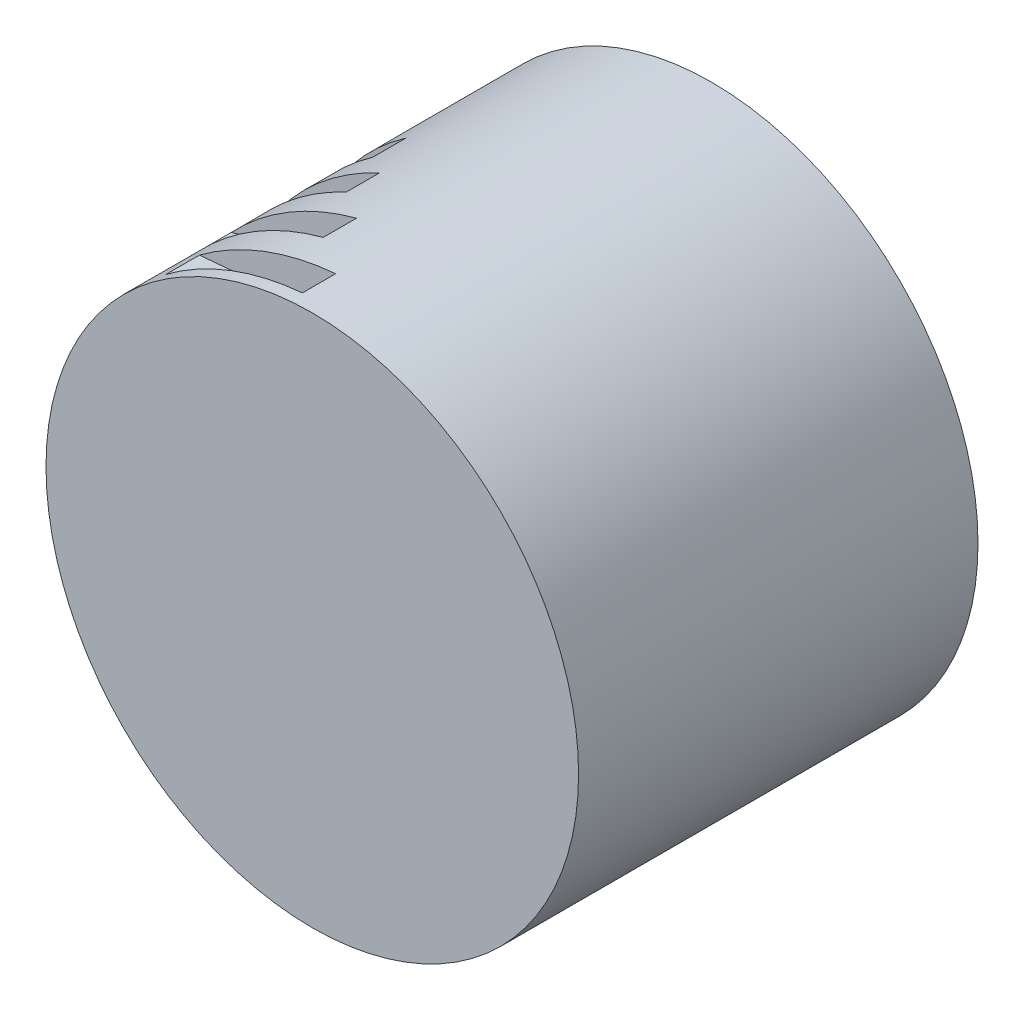
ISO-10303-21;
HEADER;
FILE_DESCRIPTION(('STEP AP214'),'2;1');
FILE_NAME('part.step','',(''),(''),'','','');
FILE_SCHEMA(('AUTOMOTIVE_DESIGN { 1 0 10303 214 1 1 1 1 }'));
ENDSEC;
DATA;
#1=APPLICATION_CONTEXT('core data for automotive mechanical design processes');
#2=APPLICATION_PROTOCOL_DEFINITION('international standard','automotive_design',2000,#1);
#3=PRODUCT_CONTEXT('',#1,'mechanical');
#4=PRODUCT('Part','Part','',(#3));
#5=PRODUCT_RELATED_PRODUCT_CATEGORY('part','',(#4));
#6=PRODUCT_DEFINITION_FORMATION('','',#4);
#7=PRODUCT_DEFINITION_CONTEXT('part definition',#1,'design');
#8=PRODUCT_DEFINITION('design','',#6,#7);
#9=PRODUCT_DEFINITION_SHAPE('','',#8);
#10=(LENGTH_UNIT() NAMED_UNIT(*) SI_UNIT(.MILLI.,.METRE.));
#11=(NAMED_UNIT(*) PLANE_ANGLE_UNIT() SI_UNIT($,.RADIAN.));
#12=(NAMED_UNIT(*) SI_UNIT($,.STERADIAN.) SOLID_ANGLE_UNIT());
#13=UNCERTAINTY_MEASURE_WITH_UNIT(LENGTH_MEASURE(1.E-05),#10,'distance_accuracy_value','');
#14=(GEOMETRIC_REPRESENTATION_CONTEXT(3) GLOBAL_UNCERTAINTY_ASSIGNED_CONTEXT((#13)) GLOBAL_UNIT_ASSIGNED_CONTEXT((#10,
#11,#12)) REPRESENTATION_CONTEXT('',''));
#15=CARTESIAN_POINT('',(0.,0.,0.));
#16=DIRECTION('',(0.,0.,1.));
#17=DIRECTION('',(1.,0.,0.));
#18=AXIS2_PLACEMENT_3D('',#15,#16,#17);
#19=CARTESIAN_POINT('',(0.,0.,300.));
#20=DIRECTION('',(0.,0.,-1.));
#21=DIRECTION('',(-1.,0.,0.));
#22=AXIS2_PLACEMENT_3D('',#19,#20,#21);
#23=CYLINDRICAL_SURFACE('',#22,400.);
#24=CARTESIAN_POINT('',(0.,0.,30.));
#25=DIRECTION('',(0.,0.,1.));
#26=DIRECTION('',(1.,0.,0.));
#27=AXIS2_PLACEMENT_3D('',#24,#25,#26);
#28=CIRCLE('',#27,400.);
#29=CARTESIAN_POINT('',(-169.047304696278,362.523114814661,30.));
#30=VERTEX_POINT('',#29);
#31=CARTESIAN_POINT('',(-334.661109746483,219.093454085813,30.));
#32=VERTEX_POINT('',#31);
#33=EDGE_CURVE('E168',#30,#32,#28,.T.);
#34=ORIENTED_EDGE('',*,*,#33,.F.);
#35=DIRECTION('',(0.,0.,1.));
#36=VECTOR('',#35,1.);
#37=CARTESIAN_POINT('',(-169.047304696278,362.523114814661,30.));
#38=LINE('',#37,#36);
#39=CARTESIAN_POINT('',(-169.047304696278,362.523114814661,80.));
#40=VERTEX_POINT('',#39);
#41=EDGE_CURVE('E186',#30,#40,#38,.T.);
#42=ORIENTED_EDGE('',*,*,#41,.T.);
#43=CARTESIAN_POINT('',(0.,0.,80.));
#44=DIRECTION('',(0.,0.,1.));
#45=DIRECTION('',(1.,0.,0.));
#46=AXIS2_PLACEMENT_3D('',#43,#44,#45);
#47=CIRCLE('',#46,400.);
#48=CARTESIAN_POINT('',(-334.661109746483,219.093454085813,80.));
#49=VERTEX_POINT('',#48);
#50=EDGE_CURVE('E179',#40,#49,#47,.T.);
#51=ORIENTED_EDGE('',*,*,#50,.T.);
#52=DIRECTION('',(0.,0.,1.));
#53=VECTOR('',#52,1.);
#54=CARTESIAN_POINT('',(-334.661109746483,219.093454085813,30.));
#55=LINE('',#54,#53);
#56=EDGE_CURVE('E178',#32,#49,#55,.T.);
#57=ORIENTED_EDGE('',*,*,#56,.F.);
#58=EDGE_LOOP('',(#34,#42,#51,#57));
#59=FACE_BOUND('',#58,.T.);
#60=CARTESIAN_POINT('',(0.,0.,-170.));
#61=DIRECTION('',(0.,0.,1.));
#62=DIRECTION('',(1.,0.,0.));
#63=AXIS2_PLACEMENT_3D('',#60,#61,#62);
#64=CIRCLE('',#63,400.);
#65=CARTESIAN_POINT('',(-282.842712474617,282.84271247462,-170.));
#66=VERTEX_POINT('',#65);
#67=CARTESIAN_POINT('',(-389.412949860939,91.4196613459148,-170.));
#68=VERTEX_POINT('',#67);
#69=EDGE_CURVE('E218',#66,#68,#64,.T.);
#70=ORIENTED_EDGE('',*,*,#69,.F.);
#71=DIRECTION('',(0.,0.,1.));
#72=VECTOR('',#71,1.);
#73=CARTESIAN_POINT('',(-282.842712474617,282.84271247462,-170.));
#74=LINE('',#73,#72);
#75=CARTESIAN_POINT('',(-282.842712474617,282.84271247462,-120.));
#76=VERTEX_POINT('',#75);
#77=EDGE_CURVE('E207',#66,#76,#74,.T.);
#78=ORIENTED_EDGE('',*,*,#77,.T.);
#79=CARTESIAN_POINT('',(0.,0.,-120.));
#80=DIRECTION('',(0.,0.,1.));
#81=DIRECTION('',(1.,0.,0.));
#82=AXIS2_PLACEMENT_3D('',#79,#80,#81);
#83=CIRCLE('',#82,400.);
#84=CARTESIAN_POINT('',(-389.412949860939,91.4196613459148,-120.));
#85=VERTEX_POINT('',#84);
#86=EDGE_CURVE('E229',#76,#85,#83,.T.);
#87=ORIENTED_EDGE('',*,*,#86,.T.);
#88=DIRECTION('',(0.,0.,1.));
#89=VECTOR('',#88,1.);
#90=CARTESIAN_POINT('',(-389.412949860939,91.4196613459148,-170.));
#91=LINE('',#90,#89);
#92=EDGE_CURVE('E228',#68,#85,#91,.T.);
#93=ORIENTED_EDGE('',*,*,#92,.F.);
#94=EDGE_LOOP('',(#70,#78,#87,#93));
#95=FACE_BOUND('',#94,.T.);
#96=CARTESIAN_POINT('',(0.,0.,-300.));
#97=DIRECTION('',(0.,0.,1.));
#98=DIRECTION('',(1.,0.,0.));
#99=AXIS2_PLACEMENT_3D('',#96,#97,#98);
#100=CIRCLE('',#99,400.);
#101=CARTESIAN_POINT('',(400.,0.,-300.));
#102=VERTEX_POINT('',#101);
#103=EDGE_CURVE('E38',#102,#102,#100,.T.);
#104=ORIENTED_EDGE('',*,*,#103,.T.);
#105=EDGE_LOOP('',(#104));
#106=FACE_BOUND('',#105,.T.);
#107=CARTESIAN_POINT('',(0.,0.,300.));
#108=DIRECTION('',(0.,0.,1.));
#109=DIRECTION('',(1.,0.,0.));
#110=AXIS2_PLACEMENT_3D('',#107,#108,#109);
#111=CIRCLE('',#110,400.);
#112=CARTESIAN_POINT('',(400.,0.,300.));
#113=VERTEX_POINT('',#112);
#114=EDGE_CURVE('E11',#113,#113,#111,.T.);
#115=ORIENTED_EDGE('',*,*,#114,.F.);
#116=EDGE_LOOP('',(#115));
#117=FACE_BOUND('',#116,.T.);
#118=CARTESIAN_POINT('',(0.,0.,230.));
#119=DIRECTION('',(0.,0.,1.));
#120=DIRECTION('',(1.,0.,0.));
#121=AXIS2_PLACEMENT_3D('',#118,#119,#120);
#122=CIRCLE('',#121,400.);
#123=CARTESIAN_POINT('',(-34.8622970990606,398.477879236698,230.));
#124=VERTEX_POINT('',#123);
#125=CARTESIAN_POINT('',(-239.544200724648,320.341342787954,230.));
#126=VERTEX_POINT('',#125);
#127=EDGE_CURVE('E243',#124,#126,#122,.T.);
#128=ORIENTED_EDGE('',*,*,#127,.F.);
#129=DIRECTION('',(0.,0.,1.));
#130=VECTOR('',#129,1.);
#131=CARTESIAN_POINT('',(-34.8622970990606,398.477879236698,230.));
#132=LINE('',#131,#130);
#133=CARTESIAN_POINT('',(-34.8622970990606,398.477879236698,280.));
#134=VERTEX_POINT('',#133);
#135=EDGE_CURVE('E262',#124,#134,#132,.T.);
#136=ORIENTED_EDGE('',*,*,#135,.T.);
#137=CARTESIAN_POINT('',(0.,0.,280.));
#138=DIRECTION('',(0.,0.,1.));
#139=DIRECTION('',(1.,0.,0.));
#140=AXIS2_PLACEMENT_3D('',#137,#138,#139);
#141=CIRCLE('',#140,400.);
#142=CARTESIAN_POINT('',(-239.544200724648,320.341342787954,280.));
#143=VERTEX_POINT('',#142);
#144=EDGE_CURVE('E254',#134,#143,#141,.T.);
#145=ORIENTED_EDGE('',*,*,#144,.T.);
#146=DIRECTION('',(0.,0.,1.));
#147=VECTOR('',#146,1.);
#148=CARTESIAN_POINT('',(-239.544200724648,320.341342787954,230.));
#149=LINE('',#148,#147);
#150=EDGE_CURVE('E253',#126,#143,#149,.T.);
#151=ORIENTED_EDGE('',*,*,#150,.F.);
#152=EDGE_LOOP('',(#128,#136,#145,#151));
#153=FACE_BOUND('',#152,.T.);
#154=CARTESIAN_POINT('',(0.,0.,-70.0000000000001));
#155=DIRECTION('',(0.,0.,1.));
#156=DIRECTION('',(1.,0.,0.));
#157=AXIS2_PLACEMENT_3D('',#154,#155,#156);
#158=CIRCLE('',#157,400.);
#159=CARTESIAN_POINT('',(-229.430574540417,327.660817715598,-70.0000000000001));
#160=VERTEX_POINT('',#159);
#161=CARTESIAN_POINT('',(-367.622034550761,157.651640374463,-70.0000000000001));
#162=VERTEX_POINT('',#161);
#163=EDGE_CURVE('E192',#160,#162,#158,.T.);
#164=ORIENTED_EDGE('',*,*,#163,.F.);
#165=DIRECTION('',(0.,0.,1.));
#166=VECTOR('',#165,1.);
#167=CARTESIAN_POINT('',(-229.430574540417,327.660817715598,-70.0000000000001));
#168=LINE('',#167,#166);
#169=CARTESIAN_POINT('',(-229.430574540417,327.660817715598,-20.0000000000001));
#170=VERTEX_POINT('',#169);
#171=EDGE_CURVE('E182',#160,#170,#168,.T.);
#172=ORIENTED_EDGE('',*,*,#171,.T.);
#173=CARTESIAN_POINT('',(0.,0.,-20.0000000000001));
#174=DIRECTION('',(0.,0.,1.));
#175=DIRECTION('',(1.,0.,0.));
#176=AXIS2_PLACEMENT_3D('',#173,#174,#175);
#177=CIRCLE('',#176,400.);
#178=CARTESIAN_POINT('',(-367.622034550761,157.651640374463,-20.0000000000001));
#179=VERTEX_POINT('',#178);
#180=EDGE_CURVE('E203',#170,#179,#177,.T.);
#181=ORIENTED_EDGE('',*,*,#180,.T.);
#182=DIRECTION('',(0.,0.,1.));
#183=VECTOR('',#182,1.);
#184=CARTESIAN_POINT('',(-367.622034550761,157.651640374463,-70.0000000000001));
#185=LINE('',#184,#183);
#186=EDGE_CURVE('E202',#162,#179,#185,.T.);
#187=ORIENTED_EDGE('',*,*,#186,.F.);
#188=EDGE_LOOP('',(#164,#172,#181,#187));
#189=FACE_BOUND('',#188,.T.);
#190=CARTESIAN_POINT('',(0.,0.,130.));
#191=DIRECTION('',(0.,0.,1.));
#192=DIRECTION('',(1.,0.,0.));
#193=AXIS2_PLACEMENT_3D('',#190,#191,#192);
#194=CIRCLE('',#193,400.);
#195=CARTESIAN_POINT('',(-103.527618041006,386.370330515628,130.));
#196=VERTEX_POINT('',#195);
#197=CARTESIAN_POINT('',(-291.531676469252,273.878224061402,130.));
#198=VERTEX_POINT('',#197);
#199=EDGE_CURVE('E153',#196,#198,#194,.T.);
#200=ORIENTED_EDGE('',*,*,#199,.F.);
#201=DIRECTION('',(0.,0.,1.));
#202=VECTOR('',#201,1.);
#203=CARTESIAN_POINT('',(-103.527618041006,386.370330515628,130.));
#204=LINE('',#203,#202);
#205=CARTESIAN_POINT('',(-103.527618041006,386.370330515628,180.));
#206=VERTEX_POINT('',#205);
#207=EDGE_CURVE('E163',#196,#206,#204,.T.);
#208=ORIENTED_EDGE('',*,*,#207,.T.);
#209=CARTESIAN_POINT('',(0.,0.,180.));
#210=DIRECTION('',(0.,0.,1.));
#211=DIRECTION('',(1.,0.,0.));
#212=AXIS2_PLACEMENT_3D('',#209,#210,#211);
#213=CIRCLE('',#212,400.);
#214=CARTESIAN_POINT('',(-291.531676469252,273.878224061402,180.));
#215=VERTEX_POINT('',#214);
#216=EDGE_CURVE('E161',#206,#215,#213,.T.);
#217=ORIENTED_EDGE('',*,*,#216,.T.);
#218=DIRECTION('',(0.,0.,1.));
#219=VECTOR('',#218,1.);
#220=CARTESIAN_POINT('',(-291.531676469252,273.878224061402,130.));
#221=LINE('',#220,#219);
#222=EDGE_CURVE('E146',#198,#215,#221,.T.);
#223=ORIENTED_EDGE('',*,*,#222,.F.);
#224=EDGE_LOOP('',(#200,#208,#217,#223));
#225=FACE_BOUND('',#224,.T.);
#226=ADVANCED_FACE('F35',(#59,#95,#106,#117,#153,#189,#225),#23,.T.);
#227=CARTESIAN_POINT('',(0.,0.,300.));
#228=DIRECTION('',(0.,0.,1.));
#229=DIRECTION('',(1.,0.,0.));
#230=AXIS2_PLACEMENT_3D('',#227,#228,#229);
#231=PLANE('',#230);
#232=ORIENTED_EDGE('',*,*,#114,.T.);
#233=EDGE_LOOP('',(#232));
#234=FACE_BOUND('',#233,.T.);
#235=ADVANCED_FACE('F293',(#234),#231,.T.);
#236=CARTESIAN_POINT('',(0.,0.,-300.));
#237=DIRECTION('',(0.,0.,1.));
#238=DIRECTION('',(1.,0.,0.));
#239=AXIS2_PLACEMENT_3D('',#236,#237,#238);
#240=PLANE('',#239);
#241=ORIENTED_EDGE('',*,*,#103,.F.);
#242=EDGE_LOOP('',(#241));
#243=FACE_BOUND('',#242,.T.);
#244=ADVANCED_FACE('F300',(#243),#240,.F.);
#245=CARTESIAN_POINT('',(-34.8622970990606,398.477879236698,230.));
#246=DIRECTION('',(0.996194698091746,0.0871557427476514,0.));
#247=DIRECTION('',(-0.0871557427476514,0.996194698091746,0.));
#248=AXIS2_PLACEMENT_3D('',#245,#246,#247);
#249=PLANE('',#248);
#250=DIRECTION('',(-0.0871557427476514,0.996194698091746,0.));
#251=VECTOR('',#250,1.);
#252=CARTESIAN_POINT('',(-34.8622970990606,398.477879236698,280.));
#253=LINE('',#252,#251);
#254=CARTESIAN_POINT('',(-29.6329525342015,338.706197351194,280.));
#255=VERTEX_POINT('',#254);
#256=EDGE_CURVE('E247',#255,#134,#253,.T.);
#257=ORIENTED_EDGE('',*,*,#256,.T.);
#258=ORIENTED_EDGE('',*,*,#135,.F.);
#259=DIRECTION('',(-0.0871557427476514,0.996194698091746,0.));
#260=VECTOR('',#259,1.);
#261=CARTESIAN_POINT('',(-34.8622970990606,398.477879236698,230.));
#262=LINE('',#261,#260);
#263=CARTESIAN_POINT('',(-29.6329525342015,338.706197351194,230.));
#264=VERTEX_POINT('',#263);
#265=EDGE_CURVE('E250',#264,#124,#262,.T.);
#266=ORIENTED_EDGE('',*,*,#265,.F.);
#267=DIRECTION('',(0.,0.,1.));
#268=VECTOR('',#267,1.);
#269=CARTESIAN_POINT('',(-29.6329525342015,338.706197351194,230.));
#270=LINE('',#269,#268);
#271=EDGE_CURVE('E265',#264,#255,#270,.T.);
#272=ORIENTED_EDGE('',*,*,#271,.T.);
#273=EDGE_LOOP('',(#257,#258,#266,#272));
#274=FACE_BOUND('',#273,.T.);
#275=ADVANCED_FACE('F278',(#274),#249,.F.);
#276=CARTESIAN_POINT('',(-29.6329525342015,338.706197351194,230.));
#277=DIRECTION('',(0.0871557427476516,-0.996194698091746,0.));
#278=DIRECTION('',(0.996194698091746,0.0871557427476516,0.));
#279=AXIS2_PLACEMENT_3D('',#276,#277,#278);
#280=PLANE('',#279);
#281=DIRECTION('',(0.996194698091746,0.0871557427476516,0.));
#282=VECTOR('',#281,1.);
#283=CARTESIAN_POINT('',(-29.6329525342015,338.706197351194,280.));
#284=LINE('',#283,#282);
#285=EDGE_CURVE('E257',#143,#255,#284,.T.);
#286=ORIENTED_EDGE('',*,*,#285,.T.);
#287=ORIENTED_EDGE('',*,*,#271,.F.);
#288=DIRECTION('',(0.996194698091746,0.0871557427476516,0.));
#289=VECTOR('',#288,1.);
#290=CARTESIAN_POINT('',(-29.6329525342015,338.706197351194,230.));
#291=LINE('',#290,#289);
#292=EDGE_CURVE('E246',#126,#264,#291,.T.);
#293=ORIENTED_EDGE('',*,*,#292,.F.);
#294=ORIENTED_EDGE('',*,*,#150,.T.);
#295=EDGE_LOOP('',(#286,#287,#293,#294));
#296=FACE_BOUND('',#295,.T.);
#297=ADVANCED_FACE('F270',(#296),#280,.F.);
#298=CARTESIAN_POINT('',(0.,0.,230.));
#299=DIRECTION('',(0.,0.,1.));
#300=DIRECTION('',(1.,0.,0.));
#301=AXIS2_PLACEMENT_3D('',#298,#299,#300);
#302=PLANE('',#301);
#303=ORIENTED_EDGE('',*,*,#127,.T.);
#304=ORIENTED_EDGE('',*,*,#292,.T.);
#305=ORIENTED_EDGE('',*,*,#265,.T.);
#306=EDGE_LOOP('',(#303,#304,#305));
#307=FACE_BOUND('',#306,.T.);
#308=ADVANCED_FACE('F281',(#307),#302,.T.);
#309=CARTESIAN_POINT('',(0.,0.,280.));
#310=DIRECTION('',(0.,0.,1.));
#311=DIRECTION('',(1.,0.,0.));
#312=AXIS2_PLACEMENT_3D('',#309,#310,#311);
#313=PLANE('',#312);
#314=ORIENTED_EDGE('',*,*,#144,.F.);
#315=ORIENTED_EDGE('',*,*,#256,.F.);
#316=ORIENTED_EDGE('',*,*,#285,.F.);
#317=EDGE_LOOP('',(#314,#315,#316));
#318=FACE_BOUND('',#317,.T.);
#319=ADVANCED_FACE('F276',(#318),#313,.F.);
#320=CARTESIAN_POINT('',(-282.842712474617,282.84271247462,-170.));
#321=DIRECTION('',(0.707106781186552,0.707106781186543,0.));
#322=DIRECTION('',(-0.707106781186543,0.707106781186552,0.));
#323=AXIS2_PLACEMENT_3D('',#320,#321,#322);
#324=PLANE('',#323);
#325=DIRECTION('',(-0.707106781186543,0.707106781186552,0.));
#326=VECTOR('',#325,1.);
#327=CARTESIAN_POINT('',(-282.842712474617,282.84271247462,-120.));
#328=LINE('',#327,#326);
#329=CARTESIAN_POINT('',(-240.416305603425,240.416305603427,-120.));
#330=VERTEX_POINT('',#329);
#331=EDGE_CURVE('E222',#330,#76,#328,.T.);
#332=ORIENTED_EDGE('',*,*,#331,.T.);
#333=ORIENTED_EDGE('',*,*,#77,.F.);
#334=DIRECTION('',(-0.707106781186543,0.707106781186552,0.));
#335=VECTOR('',#334,1.);
#336=CARTESIAN_POINT('',(-282.842712474617,282.84271247462,-170.));
#337=LINE('',#336,#335);
#338=CARTESIAN_POINT('',(-240.416305603425,240.416305603427,-170.));
#339=VERTEX_POINT('',#338);
#340=EDGE_CURVE('E225',#339,#66,#337,.T.);
#341=ORIENTED_EDGE('',*,*,#340,.F.);
#342=DIRECTION('',(0.,0.,1.));
#343=VECTOR('',#342,1.);
#344=CARTESIAN_POINT('',(-240.416305603425,240.416305603427,-170.));
#345=LINE('',#344,#343);
#346=EDGE_CURVE('E239',#339,#330,#345,.T.);
#347=ORIENTED_EDGE('',*,*,#346,.T.);
#348=EDGE_LOOP('',(#332,#333,#341,#347));
#349=FACE_BOUND('',#348,.T.);
#350=ADVANCED_FACE('F288',(#349),#324,.F.);
#351=CARTESIAN_POINT('',(-240.416305603425,240.416305603427,-170.));
#352=DIRECTION('',(0.707106781186544,-0.707106781186552,0.));
#353=DIRECTION('',(0.707106781186551,0.707106781186544,0.));
#354=AXIS2_PLACEMENT_3D('',#351,#352,#353);
#355=PLANE('',#354);
#356=DIRECTION('',(0.707106781186551,0.707106781186544,0.));
#357=VECTOR('',#356,1.);
#358=CARTESIAN_POINT('',(-240.416305603425,240.416305603427,-120.));
#359=LINE('',#358,#357);
#360=EDGE_CURVE('E232',#85,#330,#359,.T.);
#361=ORIENTED_EDGE('',*,*,#360,.T.);
#362=ORIENTED_EDGE('',*,*,#346,.F.);
#363=DIRECTION('',(0.707106781186551,0.707106781186544,0.));
#364=VECTOR('',#363,1.);
#365=CARTESIAN_POINT('',(-240.416305603425,240.416305603427,-170.));
#366=LINE('',#365,#364);
#367=EDGE_CURVE('E221',#68,#339,#366,.T.);
#368=ORIENTED_EDGE('',*,*,#367,.F.);
#369=ORIENTED_EDGE('',*,*,#92,.T.);
#370=EDGE_LOOP('',(#361,#362,#368,#369));
#371=FACE_BOUND('',#370,.T.);
#372=ADVANCED_FACE('F346',(#371),#355,.F.);
#373=CARTESIAN_POINT('',(0.,0.,-170.));
#374=DIRECTION('',(0.,0.,1.));
#375=DIRECTION('',(1.,0.,0.));
#376=AXIS2_PLACEMENT_3D('',#373,#374,#375);
#377=PLANE('',#376);
#378=ORIENTED_EDGE('',*,*,#69,.T.);
#379=ORIENTED_EDGE('',*,*,#367,.T.);
#380=ORIENTED_EDGE('',*,*,#340,.T.);
#381=EDGE_LOOP('',(#378,#379,#380));
#382=FACE_BOUND('',#381,.T.);
#383=ADVANCED_FACE('F353',(#382),#377,.T.);
#384=CARTESIAN_POINT('',(0.,0.,-120.));
#385=DIRECTION('',(0.,0.,1.));
#386=DIRECTION('',(1.,0.,0.));
#387=AXIS2_PLACEMENT_3D('',#384,#385,#386);
#388=PLANE('',#387);
#389=ORIENTED_EDGE('',*,*,#86,.F.);
#390=ORIENTED_EDGE('',*,*,#331,.F.);
#391=ORIENTED_EDGE('',*,*,#360,.F.);
#392=EDGE_LOOP('',(#389,#390,#391));
#393=FACE_BOUND('',#392,.T.);
#394=ADVANCED_FACE('F360',(#393),#388,.F.);
#395=CARTESIAN_POINT('',(-229.430574540417,327.660817715598,-70.0000000000001));
#396=DIRECTION('',(0.819152044288995,0.573576436351042,0.));
#397=DIRECTION('',(-0.573576436351042,0.819152044288995,0.));
#398=AXIS2_PLACEMENT_3D('',#395,#396,#397);
#399=PLANE('',#398);
#400=DIRECTION('',(-0.573576436351042,0.819152044288995,0.));
#401=VECTOR('',#400,1.);
#402=CARTESIAN_POINT('',(-229.430574540417,327.660817715598,-20.0000000000001));
#403=LINE('',#402,#401);
#404=CARTESIAN_POINT('',(-195.015988359354,278.511695058258,-20.0000000000001));
#405=VERTEX_POINT('',#404);
#406=EDGE_CURVE('E196',#405,#170,#403,.T.);
#407=ORIENTED_EDGE('',*,*,#406,.T.);
#408=ORIENTED_EDGE('',*,*,#171,.F.);
#409=DIRECTION('',(-0.573576436351042,0.819152044288995,0.));
#410=VECTOR('',#409,1.);
#411=CARTESIAN_POINT('',(-229.430574540417,327.660817715598,-70.0000000000001));
#412=LINE('',#411,#410);
#413=CARTESIAN_POINT('',(-195.015988359354,278.511695058258,-70.0000000000001));
#414=VERTEX_POINT('',#413);
#415=EDGE_CURVE('E199',#414,#160,#412,.T.);
#416=ORIENTED_EDGE('',*,*,#415,.F.);
#417=DIRECTION('',(0.,0.,1.));
#418=VECTOR('',#417,1.);
#419=CARTESIAN_POINT('',(-195.015988359354,278.511695058258,-70.0000000000001));
#420=LINE('',#419,#418);
#421=EDGE_CURVE('E214',#414,#405,#420,.T.);
#422=ORIENTED_EDGE('',*,*,#421,.T.);
#423=EDGE_LOOP('',(#407,#408,#416,#422));
#424=FACE_BOUND('',#423,.T.);
#425=ADVANCED_FACE('F368',(#424),#399,.F.);
#426=CARTESIAN_POINT('',(-195.015988359354,278.511695058258,-70.0000000000001));
#427=DIRECTION('',(0.573576436351042,-0.819152044288995,0.));
#428=DIRECTION('',(0.819152044288995,0.573576436351042,0.));
#429=AXIS2_PLACEMENT_3D('',#426,#427,#428);
#430=PLANE('',#429);
#431=DIRECTION('',(0.819152044288995,0.573576436351042,0.));
#432=VECTOR('',#431,1.);
#433=CARTESIAN_POINT('',(-195.015988359354,278.511695058258,-20.0000000000001));
#434=LINE('',#433,#432);
#435=EDGE_CURVE('E206',#179,#405,#434,.T.);
#436=ORIENTED_EDGE('',*,*,#435,.T.);
#437=ORIENTED_EDGE('',*,*,#421,.F.);
#438=DIRECTION('',(0.819152044288995,0.573576436351042,0.));
#439=VECTOR('',#438,1.);
#440=CARTESIAN_POINT('',(-195.015988359354,278.511695058258,-70.0000000000001));
#441=LINE('',#440,#439);
#442=EDGE_CURVE('E195',#162,#414,#441,.T.);
#443=ORIENTED_EDGE('',*,*,#442,.F.);
#444=ORIENTED_EDGE('',*,*,#186,.T.);
#445=EDGE_LOOP('',(#436,#437,#443,#444));
#446=FACE_BOUND('',#445,.T.);
#447=ADVANCED_FACE('F376',(#446),#430,.F.);
#448=CARTESIAN_POINT('',(0.,0.,-70.0000000000001));
#449=DIRECTION('',(0.,0.,1.));
#450=DIRECTION('',(1.,0.,0.));
#451=AXIS2_PLACEMENT_3D('',#448,#449,#450);
#452=PLANE('',#451);
#453=ORIENTED_EDGE('',*,*,#163,.T.);
#454=ORIENTED_EDGE('',*,*,#442,.T.);
#455=ORIENTED_EDGE('',*,*,#415,.T.);
#456=EDGE_LOOP('',(#453,#454,#455));
#457=FACE_BOUND('',#456,.T.);
#458=ADVANCED_FACE('F384',(#457),#452,.T.);
#459=CARTESIAN_POINT('',(0.,0.,-20.0000000000001));
#460=DIRECTION('',(0.,0.,1.));
#461=DIRECTION('',(1.,0.,0.));
#462=AXIS2_PLACEMENT_3D('',#459,#460,#461);
#463=PLANE('',#462);
#464=ORIENTED_EDGE('',*,*,#180,.F.);
#465=ORIENTED_EDGE('',*,*,#406,.F.);
#466=ORIENTED_EDGE('',*,*,#435,.F.);
#467=EDGE_LOOP('',(#464,#465,#466));
#468=FACE_BOUND('',#467,.T.);
#469=ADVANCED_FACE('F392',(#468),#463,.F.);
#470=CARTESIAN_POINT('',(-169.047304696278,362.523114814661,30.));
#471=DIRECTION('',(0.906307787036652,0.422618261740694,0.));
#472=DIRECTION('',(-0.422618261740694,0.906307787036652,0.));
#473=AXIS2_PLACEMENT_3D('',#470,#471,#472);
#474=PLANE('',#473);
#475=DIRECTION('',(-0.422618261740694,0.906307787036652,0.));
#476=VECTOR('',#475,1.);
#477=CARTESIAN_POINT('',(-169.047304696278,362.523114814661,80.));
#478=LINE('',#477,#476);
#479=CARTESIAN_POINT('',(-143.690208991836,308.144647592462,80.));
#480=VERTEX_POINT('',#479);
#481=EDGE_CURVE('E172',#480,#40,#478,.T.);
#482=ORIENTED_EDGE('',*,*,#481,.T.);
#483=ORIENTED_EDGE('',*,*,#41,.F.);
#484=DIRECTION('',(-0.422618261740694,0.906307787036652,0.));
#485=VECTOR('',#484,1.);
#486=CARTESIAN_POINT('',(-169.047304696278,362.523114814661,30.));
#487=LINE('',#486,#485);
#488=CARTESIAN_POINT('',(-143.690208991836,308.144647592462,30.));
#489=VERTEX_POINT('',#488);
#490=EDGE_CURVE('E175',#489,#30,#487,.T.);
#491=ORIENTED_EDGE('',*,*,#490,.F.);
#492=DIRECTION('',(0.,0.,1.));
#493=VECTOR('',#492,1.);
#494=CARTESIAN_POINT('',(-143.690208991836,308.144647592462,30.));
#495=LINE('',#494,#493);
#496=EDGE_CURVE('E189',#489,#480,#495,.T.);
#497=ORIENTED_EDGE('',*,*,#496,.T.);
#498=EDGE_LOOP('',(#482,#483,#491,#497));
#499=FACE_BOUND('',#498,.T.);
#500=ADVANCED_FACE('F400',(#499),#474,.F.);
#501=CARTESIAN_POINT('',(-143.690208991836,308.144647592462,30.));
#502=DIRECTION('',(0.422618261740694,-0.906307787036652,0.));
#503=DIRECTION('',(0.906307787036652,0.422618261740694,0.));
#504=AXIS2_PLACEMENT_3D('',#501,#502,#503);
#505=PLANE('',#504);
#506=DIRECTION('',(0.906307787036652,0.422618261740694,0.));
#507=VECTOR('',#506,1.);
#508=CARTESIAN_POINT('',(-143.690208991836,308.144647592462,80.));
#509=LINE('',#508,#507);
#510=EDGE_CURVE('E57',#49,#480,#509,.T.);
#511=ORIENTED_EDGE('',*,*,#510,.T.);
#512=ORIENTED_EDGE('',*,*,#496,.F.);
#513=DIRECTION('',(0.906307787036652,0.422618261740694,0.));
#514=VECTOR('',#513,1.);
#515=CARTESIAN_POINT('',(-143.690208991836,308.144647592462,30.));
#516=LINE('',#515,#514);
#517=EDGE_CURVE('E171',#32,#489,#516,.T.);
#518=ORIENTED_EDGE('',*,*,#517,.F.);
#519=ORIENTED_EDGE('',*,*,#56,.T.);
#520=EDGE_LOOP('',(#511,#512,#518,#519));
#521=FACE_BOUND('',#520,.T.);
#522=ADVANCED_FACE('F408',(#521),#505,.F.);
#523=CARTESIAN_POINT('',(0.,0.,30.));
#524=DIRECTION('',(0.,0.,1.));
#525=DIRECTION('',(1.,0.,0.));
#526=AXIS2_PLACEMENT_3D('',#523,#524,#525);
#527=PLANE('',#526);
#528=ORIENTED_EDGE('',*,*,#33,.T.);
#529=ORIENTED_EDGE('',*,*,#517,.T.);
#530=ORIENTED_EDGE('',*,*,#490,.T.);
#531=EDGE_LOOP('',(#528,#529,#530));
#532=FACE_BOUND('',#531,.T.);
#533=ADVANCED_FACE('F416',(#532),#527,.T.);
#534=CARTESIAN_POINT('',(0.,0.,80.));
#535=DIRECTION('',(0.,0.,1.));
#536=DIRECTION('',(1.,0.,0.));
#537=AXIS2_PLACEMENT_3D('',#534,#535,#536);
#538=PLANE('',#537);
#539=ORIENTED_EDGE('',*,*,#50,.F.);
#540=ORIENTED_EDGE('',*,*,#481,.F.);
#541=ORIENTED_EDGE('',*,*,#510,.F.);
#542=EDGE_LOOP('',(#539,#540,#541));
#543=FACE_BOUND('',#542,.T.);
#544=ADVANCED_FACE('F424',(#543),#538,.F.);
#545=CARTESIAN_POINT('',(-103.527618041006,386.370330515628,130.));
#546=DIRECTION('',(0.96592582628907,0.258819045102515,0.));
#547=DIRECTION('',(-0.258819045102515,0.96592582628907,0.));
#548=AXIS2_PLACEMENT_3D('',#545,#546,#547);
#549=PLANE('',#548);
#550=DIRECTION('',(-0.258819045102515,0.96592582628907,0.));
#551=VECTOR('',#550,1.);
#552=CARTESIAN_POINT('',(-103.527618041006,386.370330515628,180.));
#553=LINE('',#552,#551);
#554=CARTESIAN_POINT('',(-87.9984753348549,328.414780938284,180.));
#555=VERTEX_POINT('',#554);
#556=EDGE_CURVE('E159',#555,#206,#553,.T.);
#557=ORIENTED_EDGE('',*,*,#556,.T.);
#558=ORIENTED_EDGE('',*,*,#207,.F.);
#559=DIRECTION('',(-0.258819045102515,0.96592582628907,0.));
#560=VECTOR('',#559,1.);
#561=CARTESIAN_POINT('',(-103.527618041006,386.370330515628,130.));
#562=LINE('',#561,#560);
#563=CARTESIAN_POINT('',(-87.9984753348549,328.414780938284,130.));
#564=VERTEX_POINT('',#563);
#565=EDGE_CURVE('E152',#564,#196,#562,.T.);
#566=ORIENTED_EDGE('',*,*,#565,.F.);
#567=DIRECTION('',(0.,0.,1.));
#568=VECTOR('',#567,1.);
#569=CARTESIAN_POINT('',(-87.9984753348549,328.414780938284,130.));
#570=LINE('',#569,#568);
#571=EDGE_CURVE('E148',#564,#555,#570,.T.);
#572=ORIENTED_EDGE('',*,*,#571,.T.);
#573=EDGE_LOOP('',(#557,#558,#566,#572));
#574=FACE_BOUND('',#573,.T.);
#575=ADVANCED_FACE('F432',(#574),#549,.F.);
#576=CARTESIAN_POINT('',(-87.9984753348549,328.414780938284,130.));
#577=DIRECTION('',(0.258819045102515,-0.96592582628907,0.));
#578=DIRECTION('',(0.96592582628907,0.258819045102515,0.));
#579=AXIS2_PLACEMENT_3D('',#576,#577,#578);
#580=PLANE('',#579);
#581=DIRECTION('',(0.96592582628907,0.258819045102515,0.));
#582=VECTOR('',#581,1.);
#583=CARTESIAN_POINT('',(-87.9984753348549,328.414780938284,180.));
#584=LINE('',#583,#582);
#585=EDGE_CURVE('E49',#215,#555,#584,.T.);
#586=ORIENTED_EDGE('',*,*,#585,.T.);
#587=ORIENTED_EDGE('',*,*,#571,.F.);
#588=DIRECTION('',(0.96592582628907,0.258819045102515,0.));
#589=VECTOR('',#588,1.);
#590=CARTESIAN_POINT('',(-87.9984753348549,328.414780938284,130.));
#591=LINE('',#590,#589);
#592=EDGE_CURVE('E142',#198,#564,#591,.T.);
#593=ORIENTED_EDGE('',*,*,#592,.F.);
#594=ORIENTED_EDGE('',*,*,#222,.T.);
#595=EDGE_LOOP('',(#586,#587,#593,#594));
#596=FACE_BOUND('',#595,.T.);
#597=ADVANCED_FACE('F144',(#596),#580,.F.);
#598=CARTESIAN_POINT('',(0.,0.,130.));
#599=DIRECTION('',(0.,0.,1.));
#600=DIRECTION('',(1.,0.,0.));
#601=AXIS2_PLACEMENT_3D('',#598,#599,#600);
#602=PLANE('',#601);
#603=ORIENTED_EDGE('',*,*,#199,.T.);
#604=ORIENTED_EDGE('',*,*,#592,.T.);
#605=ORIENTED_EDGE('',*,*,#565,.T.);
#606=EDGE_LOOP('',(#603,#604,#605));
#607=FACE_BOUND('',#606,.T.);
#608=ADVANCED_FACE('F156',(#607),#602,.T.);
#609=CARTESIAN_POINT('',(0.,0.,180.));
#610=DIRECTION('',(0.,0.,1.));
#611=DIRECTION('',(1.,0.,0.));
#612=AXIS2_PLACEMENT_3D('',#609,#610,#611);
#613=PLANE('',#612);
#614=ORIENTED_EDGE('',*,*,#216,.F.);
#615=ORIENTED_EDGE('',*,*,#556,.F.);
#616=ORIENTED_EDGE('',*,*,#585,.F.);
#617=EDGE_LOOP('',(#614,#615,#616));
#618=FACE_BOUND('',#617,.T.);
#619=ADVANCED_FACE('F452',(#618),#613,.F.);
#620=CLOSED_SHELL('',(#226,#235,#244,#275,#297,#308,#319,#350,#372,#383,#394,#425,#447,#458,
#469,#500,#522,#533,#544,#575,#597,#608,#619));
#621=MANIFOLD_SOLID_BREP('B2',#620);
#622=ADVANCED_BREP_SHAPE_REPRESENTATION('',(#18,#621),#14);
#623=SHAPE_DEFINITION_REPRESENTATION(#9,#622);
ENDSEC;
END-ISO-10303-21;
